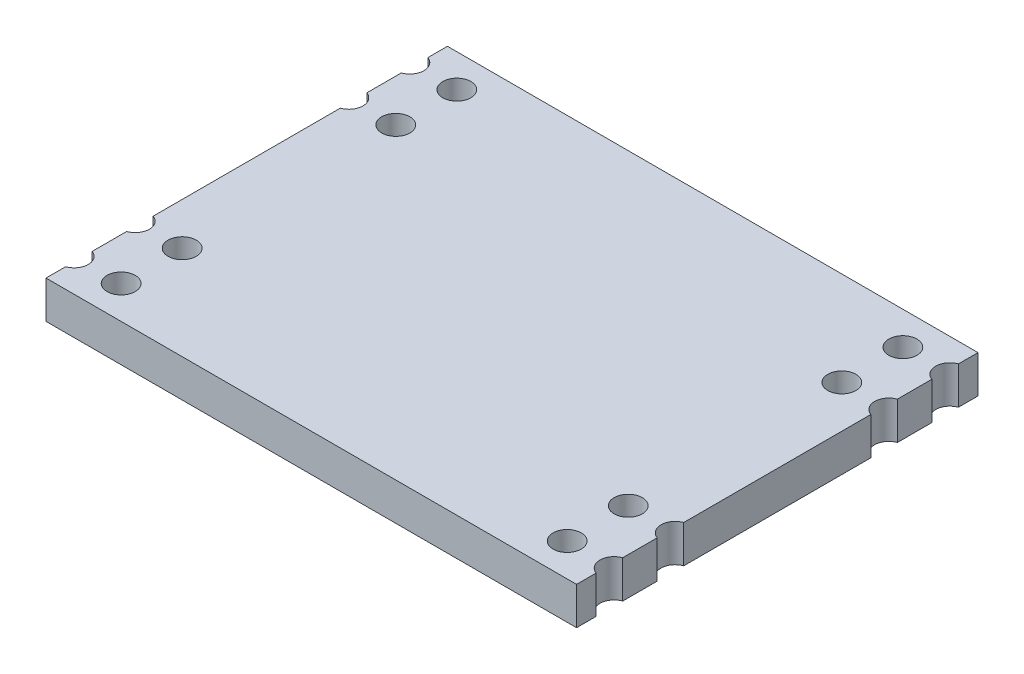
ISO-10303-21;
HEADER;
FILE_DESCRIPTION(('STEP AP214'),'2;1');
FILE_NAME('part.step','',(''),(''),'','','');
FILE_SCHEMA(('AUTOMOTIVE_DESIGN { 1 0 10303 214 1 1 1 1 }'));
ENDSEC;
DATA;
#1=APPLICATION_CONTEXT('core data for automotive mechanical design processes');
#2=APPLICATION_PROTOCOL_DEFINITION('international standard','automotive_design',2000,#1);
#3=PRODUCT_CONTEXT('',#1,'mechanical');
#4=PRODUCT('Part','Part','',(#3));
#5=PRODUCT_RELATED_PRODUCT_CATEGORY('part','',(#4));
#6=PRODUCT_DEFINITION_FORMATION('','',#4);
#7=PRODUCT_DEFINITION_CONTEXT('part definition',#1,'design');
#8=PRODUCT_DEFINITION('design','',#6,#7);
#9=PRODUCT_DEFINITION_SHAPE('','',#8);
#10=(LENGTH_UNIT() NAMED_UNIT(*) SI_UNIT(.MILLI.,.METRE.));
#11=(NAMED_UNIT(*) PLANE_ANGLE_UNIT() SI_UNIT($,.RADIAN.));
#12=(NAMED_UNIT(*) SI_UNIT($,.STERADIAN.) SOLID_ANGLE_UNIT());
#13=UNCERTAINTY_MEASURE_WITH_UNIT(LENGTH_MEASURE(1.E-05),#10,'distance_accuracy_value','');
#14=(GEOMETRIC_REPRESENTATION_CONTEXT(3) GLOBAL_UNCERTAINTY_ASSIGNED_CONTEXT((#13)) GLOBAL_UNIT_ASSIGNED_CONTEXT((#10,
#11,#12)) REPRESENTATION_CONTEXT('',''));
#15=CARTESIAN_POINT('',(0.,0.,0.));
#16=DIRECTION('',(0.,0.,1.));
#17=DIRECTION('',(1.,0.,0.));
#18=AXIS2_PLACEMENT_3D('',#15,#16,#17);
#19=CARTESIAN_POINT('',(11.3,1.6,-8.55));
#20=DIRECTION('',(-1.,0.,0.));
#21=DIRECTION('',(0.,0.,1.));
#22=AXIS2_PLACEMENT_3D('',#19,#20,#21);
#23=PLANE('',#22);
#24=DIRECTION('',(0.,0.,-1.));
#25=VECTOR('',#24,1.);
#26=CARTESIAN_POINT('',(11.3,0.,-8.55));
#27=LINE('',#26,#25);
#28=CARTESIAN_POINT('',(11.3,0.,8.55000000000001));
#29=VERTEX_POINT('',#28);
#30=CARTESIAN_POINT('',(11.3,0.,7.71568542494924));
#31=VERTEX_POINT('',#30);
#32=EDGE_CURVE('E197',#29,#31,#27,.T.);
#33=ORIENTED_EDGE('',*,*,#32,.T.);
#34=DIRECTION('',(0.,1.,0.));
#35=VECTOR('',#34,1.);
#36=CARTESIAN_POINT('',(11.3,0.,7.71568542494924));
#37=LINE('',#36,#35);
#38=CARTESIAN_POINT('',(11.3,1.6,7.71568542494924));
#39=VERTEX_POINT('',#38);
#40=EDGE_CURVE('E57',#31,#39,#37,.T.);
#41=ORIENTED_EDGE('',*,*,#40,.T.);
#42=DIRECTION('',(0.,0.,-1.));
#43=VECTOR('',#42,1.);
#44=CARTESIAN_POINT('',(11.3,1.6,-8.55));
#45=LINE('',#44,#43);
#46=CARTESIAN_POINT('',(11.3,1.6,8.55000000000001));
#47=VERTEX_POINT('',#46);
#48=EDGE_CURVE('E276',#47,#39,#45,.T.);
#49=ORIENTED_EDGE('',*,*,#48,.F.);
#50=DIRECTION('',(0.,-1.,0.));
#51=VECTOR('',#50,1.);
#52=CARTESIAN_POINT('',(11.3,1.6,8.55000000000001));
#53=LINE('',#52,#51);
#54=EDGE_CURVE('E221',#47,#29,#53,.T.);
#55=ORIENTED_EDGE('',*,*,#54,.T.);
#56=EDGE_LOOP('',(#33,#41,#49,#55));
#57=FACE_BOUND('',#56,.T.);
#58=ADVANCED_FACE('F34',(#57),#23,.F.);
#59=CARTESIAN_POINT('',(11.3,1.6,6.58431457505076));
#60=VERTEX_POINT('',#59);
#61=CARTESIAN_POINT('',(11.3,1.6,5.11568542494924));
#62=VERTEX_POINT('',#61);
#63=EDGE_CURVE('E280',#60,#62,#45,.T.);
#64=ORIENTED_EDGE('',*,*,#63,.F.);
#65=DIRECTION('',(0.,1.,0.));
#66=VECTOR('',#65,1.);
#67=CARTESIAN_POINT('',(11.3,0.,6.58431457505076));
#68=LINE('',#67,#66);
#69=CARTESIAN_POINT('',(11.3,0.,6.58431457505076));
#70=VERTEX_POINT('',#69);
#71=EDGE_CURVE('E299',#60,#70,#68,.F.);
#72=ORIENTED_EDGE('',*,*,#71,.T.);
#73=CARTESIAN_POINT('',(11.3,0.,5.11568542494924));
#74=VERTEX_POINT('',#73);
#75=EDGE_CURVE('E194',#70,#74,#27,.T.);
#76=ORIENTED_EDGE('',*,*,#75,.T.);
#77=DIRECTION('',(0.,1.,0.));
#78=VECTOR('',#77,1.);
#79=CARTESIAN_POINT('',(11.3,0.,5.11568542494924));
#80=LINE('',#79,#78);
#81=EDGE_CURVE('E49',#74,#62,#80,.T.);
#82=ORIENTED_EDGE('',*,*,#81,.T.);
#83=EDGE_LOOP('',(#64,#72,#76,#82));
#84=FACE_BOUND('',#83,.T.);
#85=ADVANCED_FACE('F390',(#84),#23,.F.);
#86=CARTESIAN_POINT('',(-11.3,1.6,-8.55));
#87=DIRECTION('',(1.,0.,0.));
#88=DIRECTION('',(0.,0.,-1.));
#89=AXIS2_PLACEMENT_3D('',#86,#87,#88);
#90=PLANE('',#89);
#91=DIRECTION('',(0.,1.,0.));
#92=VECTOR('',#91,1.);
#93=CARTESIAN_POINT('',(-11.3,0.,6.58431457505076));
#94=LINE('',#93,#92);
#95=CARTESIAN_POINT('',(-11.3,1.6,6.58431457505076));
#96=VERTEX_POINT('',#95);
#97=CARTESIAN_POINT('',(-11.3,0.,6.58431457505076));
#98=VERTEX_POINT('',#97);
#99=EDGE_CURVE('E331',#96,#98,#94,.F.);
#100=ORIENTED_EDGE('',*,*,#99,.F.);
#101=DIRECTION('',(0.,0.,1.));
#102=VECTOR('',#101,1.);
#103=CARTESIAN_POINT('',(-11.3,1.6,-8.55));
#104=LINE('',#103,#102);
#105=CARTESIAN_POINT('',(-11.3,1.6,5.11568542494924));
#106=VERTEX_POINT('',#105);
#107=EDGE_CURVE('E469',#106,#96,#104,.T.);
#108=ORIENTED_EDGE('',*,*,#107,.F.);
#109=DIRECTION('',(0.,1.,0.));
#110=VECTOR('',#109,1.);
#111=CARTESIAN_POINT('',(-11.3,0.,5.11568542494924));
#112=LINE('',#111,#110);
#113=CARTESIAN_POINT('',(-11.3,0.,5.11568542494924));
#114=VERTEX_POINT('',#113);
#115=EDGE_CURVE('E319',#114,#106,#112,.T.);
#116=ORIENTED_EDGE('',*,*,#115,.F.);
#117=DIRECTION('',(0.,0.,1.));
#118=VECTOR('',#117,1.);
#119=CARTESIAN_POINT('',(-11.3,0.,-8.55));
#120=LINE('',#119,#118);
#121=EDGE_CURVE('E212',#114,#98,#120,.T.);
#122=ORIENTED_EDGE('',*,*,#121,.T.);
#123=EDGE_LOOP('',(#100,#108,#116,#122));
#124=FACE_BOUND('',#123,.T.);
#125=ADVANCED_FACE('F394',(#124),#90,.F.);
#126=DIRECTION('',(0.,1.,0.));
#127=VECTOR('',#126,1.);
#128=CARTESIAN_POINT('',(-11.3,0.,7.71568542494924));
#129=LINE('',#128,#127);
#130=CARTESIAN_POINT('',(-11.3,0.,7.71568542494924));
#131=VERTEX_POINT('',#130);
#132=CARTESIAN_POINT('',(-11.3,1.6,7.71568542494924));
#133=VERTEX_POINT('',#132);
#134=EDGE_CURVE('E329',#131,#133,#129,.T.);
#135=ORIENTED_EDGE('',*,*,#134,.F.);
#136=CARTESIAN_POINT('',(-11.3,0.,8.55000000000001));
#137=VERTEX_POINT('',#136);
#138=EDGE_CURVE('E207',#131,#137,#120,.T.);
#139=ORIENTED_EDGE('',*,*,#138,.T.);
#140=DIRECTION('',(0.,-1.,0.));
#141=VECTOR('',#140,1.);
#142=CARTESIAN_POINT('',(-11.3,1.6,8.55000000000001));
#143=LINE('',#142,#141);
#144=CARTESIAN_POINT('',(-11.3,1.6,8.55000000000001));
#145=VERTEX_POINT('',#144);
#146=EDGE_CURVE('E223',#145,#137,#143,.T.);
#147=ORIENTED_EDGE('',*,*,#146,.F.);
#148=EDGE_CURVE('E283',#133,#145,#104,.T.);
#149=ORIENTED_EDGE('',*,*,#148,.F.);
#150=EDGE_LOOP('',(#135,#139,#147,#149));
#151=FACE_BOUND('',#150,.T.);
#152=ADVANCED_FACE('F405',(#151),#90,.F.);
#153=DIRECTION('',(0.,1.,0.));
#154=VECTOR('',#153,1.);
#155=CARTESIAN_POINT('',(-11.3,0.,3.98431457505076));
#156=LINE('',#155,#154);
#157=CARTESIAN_POINT('',(-11.3,1.6,3.98431457505076));
#158=VERTEX_POINT('',#157);
#159=CARTESIAN_POINT('',(-11.3,0.,3.98431457505076));
#160=VERTEX_POINT('',#159);
#161=EDGE_CURVE('E327',#158,#160,#156,.F.);
#162=ORIENTED_EDGE('',*,*,#161,.F.);
#163=CARTESIAN_POINT('',(-11.3,1.6,-3.98431457505076));
#164=VERTEX_POINT('',#163);
#165=EDGE_CURVE('E455',#164,#158,#104,.T.);
#166=ORIENTED_EDGE('',*,*,#165,.F.);
#167=DIRECTION('',(0.,1.,0.));
#168=VECTOR('',#167,1.);
#169=CARTESIAN_POINT('',(-11.3,0.,-3.98431457505076));
#170=LINE('',#169,#168);
#171=CARTESIAN_POINT('',(-11.3,0.,-3.98431457505076));
#172=VERTEX_POINT('',#171);
#173=EDGE_CURVE('E242',#164,#172,#170,.F.);
#174=ORIENTED_EDGE('',*,*,#173,.T.);
#175=EDGE_CURVE('E453',#172,#160,#120,.T.);
#176=ORIENTED_EDGE('',*,*,#175,.T.);
#177=EDGE_LOOP('',(#162,#166,#174,#176));
#178=FACE_BOUND('',#177,.T.);
#179=ADVANCED_FACE('F398',(#178),#90,.F.);
#180=DIRECTION('',(0.,1.,0.));
#181=VECTOR('',#180,1.);
#182=CARTESIAN_POINT('',(11.3,0.,-6.58431457505076));
#183=LINE('',#182,#181);
#184=CARTESIAN_POINT('',(11.3,1.6,-6.58431457505076));
#185=VERTEX_POINT('',#184);
#186=CARTESIAN_POINT('',(11.3,0.,-6.58431457505076));
#187=VERTEX_POINT('',#186);
#188=EDGE_CURVE('E360',#185,#187,#183,.F.);
#189=ORIENTED_EDGE('',*,*,#188,.F.);
#190=CARTESIAN_POINT('',(11.3,1.6,-5.11568542494923));
#191=VERTEX_POINT('',#190);
#192=EDGE_CURVE('E281',#191,#185,#45,.T.);
#193=ORIENTED_EDGE('',*,*,#192,.F.);
#194=DIRECTION('',(0.,1.,0.));
#195=VECTOR('',#194,1.);
#196=CARTESIAN_POINT('',(11.3,0.,-5.11568542494923));
#197=LINE('',#196,#195);
#198=CARTESIAN_POINT('',(11.3,0.,-5.11568542494923));
#199=VERTEX_POINT('',#198);
#200=EDGE_CURVE('E348',#199,#191,#197,.T.);
#201=ORIENTED_EDGE('',*,*,#200,.F.);
#202=EDGE_CURVE('E195',#199,#187,#27,.T.);
#203=ORIENTED_EDGE('',*,*,#202,.T.);
#204=EDGE_LOOP('',(#189,#193,#201,#203));
#205=FACE_BOUND('',#204,.T.);
#206=ADVANCED_FACE('F36',(#205),#23,.F.);
#207=DIRECTION('',(0.,1.,0.));
#208=VECTOR('',#207,1.);
#209=CARTESIAN_POINT('',(11.3,0.,-7.71568542494923));
#210=LINE('',#209,#208);
#211=CARTESIAN_POINT('',(11.3,0.,-7.71568542494923));
#212=VERTEX_POINT('',#211);
#213=CARTESIAN_POINT('',(11.3,1.6,-7.71568542494923));
#214=VERTEX_POINT('',#213);
#215=EDGE_CURVE('E358',#212,#214,#210,.T.);
#216=ORIENTED_EDGE('',*,*,#215,.F.);
#217=CARTESIAN_POINT('',(11.3,0.,-8.55));
#218=VERTEX_POINT('',#217);
#219=EDGE_CURVE('E198',#212,#218,#27,.T.);
#220=ORIENTED_EDGE('',*,*,#219,.T.);
#221=DIRECTION('',(0.,-1.,0.));
#222=VECTOR('',#221,1.);
#223=CARTESIAN_POINT('',(11.3,1.6,-8.55));
#224=LINE('',#223,#222);
#225=CARTESIAN_POINT('',(11.3,1.6,-8.55));
#226=VERTEX_POINT('',#225);
#227=EDGE_CURVE('E11',#226,#218,#224,.T.);
#228=ORIENTED_EDGE('',*,*,#227,.F.);
#229=EDGE_CURVE('E220',#214,#226,#45,.T.);
#230=ORIENTED_EDGE('',*,*,#229,.F.);
#231=EDGE_LOOP('',(#216,#220,#228,#230));
#232=FACE_BOUND('',#231,.T.);
#233=ADVANCED_FACE('F396',(#232),#23,.F.);
#234=CARTESIAN_POINT('',(11.3,1.6,3.98431457505076));
#235=VERTEX_POINT('',#234);
#236=CARTESIAN_POINT('',(11.3,1.6,-3.98431457505076));
#237=VERTEX_POINT('',#236);
#238=EDGE_CURVE('E186',#235,#237,#45,.T.);
#239=ORIENTED_EDGE('',*,*,#238,.F.);
#240=DIRECTION('',(0.,1.,0.));
#241=VECTOR('',#240,1.);
#242=CARTESIAN_POINT('',(11.3,0.,3.98431457505076));
#243=LINE('',#242,#241);
#244=CARTESIAN_POINT('',(11.3,0.,3.98431457505076));
#245=VERTEX_POINT('',#244);
#246=EDGE_CURVE('E171',#235,#245,#243,.F.);
#247=ORIENTED_EDGE('',*,*,#246,.T.);
#248=CARTESIAN_POINT('',(11.3,0.,-3.98431457505076));
#249=VERTEX_POINT('',#248);
#250=EDGE_CURVE('E184',#245,#249,#27,.T.);
#251=ORIENTED_EDGE('',*,*,#250,.T.);
#252=DIRECTION('',(0.,1.,0.));
#253=VECTOR('',#252,1.);
#254=CARTESIAN_POINT('',(11.3,0.,-3.98431457505076));
#255=LINE('',#254,#253);
#256=EDGE_CURVE('E356',#237,#249,#255,.F.);
#257=ORIENTED_EDGE('',*,*,#256,.F.);
#258=EDGE_LOOP('',(#239,#247,#251,#257));
#259=FACE_BOUND('',#258,.T.);
#260=ADVANCED_FACE('F182',(#259),#23,.F.);
#261=CARTESIAN_POINT('',(-11.3,0.,-8.55));
#262=VERTEX_POINT('',#261);
#263=CARTESIAN_POINT('',(-11.3,0.,-7.71568542494924));
#264=VERTEX_POINT('',#263);
#265=EDGE_CURVE('E214',#262,#264,#120,.T.);
#266=ORIENTED_EDGE('',*,*,#265,.T.);
#267=DIRECTION('',(0.,1.,0.));
#268=VECTOR('',#267,1.);
#269=CARTESIAN_POINT('',(-11.3,0.,-7.71568542494924));
#270=LINE('',#269,#268);
#271=CARTESIAN_POINT('',(-11.3,1.6,-7.71568542494924));
#272=VERTEX_POINT('',#271);
#273=EDGE_CURVE('E262',#264,#272,#270,.T.);
#274=ORIENTED_EDGE('',*,*,#273,.T.);
#275=CARTESIAN_POINT('',(-11.3,1.6,-8.55));
#276=VERTEX_POINT('',#275);
#277=EDGE_CURVE('E232',#276,#272,#104,.T.);
#278=ORIENTED_EDGE('',*,*,#277,.F.);
#279=DIRECTION('',(0.,-1.,0.));
#280=VECTOR('',#279,1.);
#281=CARTESIAN_POINT('',(-11.3,1.6,-8.55));
#282=LINE('',#281,#280);
#283=EDGE_CURVE('E42',#276,#262,#282,.T.);
#284=ORIENTED_EDGE('',*,*,#283,.T.);
#285=EDGE_LOOP('',(#266,#274,#278,#284));
#286=FACE_BOUND('',#285,.T.);
#287=ADVANCED_FACE('F229',(#286),#90,.F.);
#288=CARTESIAN_POINT('',(-11.3,1.6,-6.58431457505076));
#289=VERTEX_POINT('',#288);
#290=CARTESIAN_POINT('',(-11.3,1.6,-5.11568542494924));
#291=VERTEX_POINT('',#290);
#292=EDGE_CURVE('E284',#289,#291,#104,.T.);
#293=ORIENTED_EDGE('',*,*,#292,.F.);
#294=DIRECTION('',(0.,1.,0.));
#295=VECTOR('',#294,1.);
#296=CARTESIAN_POINT('',(-11.3,0.,-6.58431457505076));
#297=LINE('',#296,#295);
#298=CARTESIAN_POINT('',(-11.3,0.,-6.58431457505076));
#299=VERTEX_POINT('',#298);
#300=EDGE_CURVE('E260',#289,#299,#297,.F.);
#301=ORIENTED_EDGE('',*,*,#300,.T.);
#302=CARTESIAN_POINT('',(-11.3,0.,-5.11568542494924));
#303=VERTEX_POINT('',#302);
#304=EDGE_CURVE('E218',#299,#303,#120,.T.);
#305=ORIENTED_EDGE('',*,*,#304,.T.);
#306=DIRECTION('',(0.,1.,0.));
#307=VECTOR('',#306,1.);
#308=CARTESIAN_POINT('',(-11.3,0.,-5.11568542494924));
#309=LINE('',#308,#307);
#310=EDGE_CURVE('E246',#303,#291,#309,.T.);
#311=ORIENTED_EDGE('',*,*,#310,.T.);
#312=EDGE_LOOP('',(#293,#301,#305,#311));
#313=FACE_BOUND('',#312,.T.);
#314=ADVANCED_FACE('F413',(#313),#90,.F.);
#315=CARTESIAN_POINT('',(-11.3,1.6,-8.55));
#316=DIRECTION('',(0.,0.,1.));
#317=DIRECTION('',(1.,0.,0.));
#318=AXIS2_PLACEMENT_3D('',#315,#316,#317);
#319=PLANE('',#318);
#320=DIRECTION('',(-1.,0.,0.));
#321=VECTOR('',#320,1.);
#322=CARTESIAN_POINT('',(-11.3,0.,-8.55));
#323=LINE('',#322,#321);
#324=EDGE_CURVE('E203',#218,#262,#323,.T.);
#325=ORIENTED_EDGE('',*,*,#324,.T.);
#326=ORIENTED_EDGE('',*,*,#283,.F.);
#327=DIRECTION('',(-1.,0.,0.));
#328=VECTOR('',#327,1.);
#329=CARTESIAN_POINT('',(-11.3,1.6,-8.55));
#330=LINE('',#329,#328);
#331=EDGE_CURVE('E279',#226,#276,#330,.T.);
#332=ORIENTED_EDGE('',*,*,#331,.F.);
#333=ORIENTED_EDGE('',*,*,#227,.T.);
#334=EDGE_LOOP('',(#325,#326,#332,#333));
#335=FACE_BOUND('',#334,.T.);
#336=ADVANCED_FACE('F417',(#335),#319,.F.);
#337=CARTESIAN_POINT('',(-11.3,1.6,8.55000000000001));
#338=DIRECTION('',(0.,0.,-1.));
#339=DIRECTION('',(-1.,0.,0.));
#340=AXIS2_PLACEMENT_3D('',#337,#338,#339);
#341=PLANE('',#340);
#342=DIRECTION('',(1.,0.,0.));
#343=VECTOR('',#342,1.);
#344=CARTESIAN_POINT('',(-11.3,0.,8.55000000000001));
#345=LINE('',#344,#343);
#346=EDGE_CURVE('E217',#137,#29,#345,.T.);
#347=ORIENTED_EDGE('',*,*,#346,.T.);
#348=ORIENTED_EDGE('',*,*,#54,.F.);
#349=DIRECTION('',(1.,0.,0.));
#350=VECTOR('',#349,1.);
#351=CARTESIAN_POINT('',(-11.3,1.6,8.55000000000001));
#352=LINE('',#351,#350);
#353=EDGE_CURVE('E224',#145,#47,#352,.T.);
#354=ORIENTED_EDGE('',*,*,#353,.F.);
#355=ORIENTED_EDGE('',*,*,#146,.T.);
#356=EDGE_LOOP('',(#347,#348,#354,#355));
#357=FACE_BOUND('',#356,.T.);
#358=ADVANCED_FACE('F296',(#357),#341,.F.);
#359=CARTESIAN_POINT('',(0.,1.6,0.));
#360=DIRECTION('',(0.,1.,0.));
#361=DIRECTION('',(0.,0.,1.));
#362=AXIS2_PLACEMENT_3D('',#359,#360,#361);
#363=PLANE('',#362);
#364=CARTESIAN_POINT('',(11.5,1.6,7.15));
#365=DIRECTION('',(0.,1.,0.));
#366=DIRECTION('',(0.,0.,-1.));
#367=AXIS2_PLACEMENT_3D('',#364,#365,#366);
#368=CIRCLE('',#367,0.6);
#369=EDGE_CURVE('E177',#60,#39,#368,.T.);
#370=ORIENTED_EDGE('',*,*,#369,.F.);
#371=ORIENTED_EDGE('',*,*,#63,.T.);
#372=CARTESIAN_POINT('',(11.5,1.6,4.55));
#373=DIRECTION('',(0.,1.,0.));
#374=DIRECTION('',(0.,0.,-1.));
#375=AXIS2_PLACEMENT_3D('',#372,#373,#374);
#376=CIRCLE('',#375,0.6);
#377=EDGE_CURVE('E178',#235,#62,#376,.T.);
#378=ORIENTED_EDGE('',*,*,#377,.F.);
#379=ORIENTED_EDGE('',*,*,#238,.T.);
#380=CARTESIAN_POINT('',(11.5,1.6,-4.55));
#381=DIRECTION('',(0.,-1.,0.));
#382=DIRECTION('',(0.,0.,1.));
#383=AXIS2_PLACEMENT_3D('',#380,#381,#382);
#384=CIRCLE('',#383,0.6);
#385=EDGE_CURVE('E337',#237,#191,#384,.T.);
#386=ORIENTED_EDGE('',*,*,#385,.T.);
#387=ORIENTED_EDGE('',*,*,#192,.T.);
#388=CARTESIAN_POINT('',(11.5,1.6,-7.15));
#389=DIRECTION('',(0.,-1.,0.));
#390=DIRECTION('',(0.,0.,1.));
#391=AXIS2_PLACEMENT_3D('',#388,#389,#390);
#392=CIRCLE('',#391,0.6);
#393=EDGE_CURVE('E349',#185,#214,#392,.T.);
#394=ORIENTED_EDGE('',*,*,#393,.T.);
#395=ORIENTED_EDGE('',*,*,#229,.T.);
#396=ORIENTED_EDGE('',*,*,#331,.T.);
#397=ORIENTED_EDGE('',*,*,#277,.T.);
#398=CARTESIAN_POINT('',(-11.5,1.6,-7.15));
#399=DIRECTION('',(0.,1.,0.));
#400=DIRECTION('',(0.,0.,1.));
#401=AXIS2_PLACEMENT_3D('',#398,#399,#400);
#402=CIRCLE('',#401,0.6);
#403=EDGE_CURVE('E243',#289,#272,#402,.T.);
#404=ORIENTED_EDGE('',*,*,#403,.F.);
#405=ORIENTED_EDGE('',*,*,#292,.T.);
#406=CARTESIAN_POINT('',(-11.5,1.6,-4.55));
#407=DIRECTION('',(0.,1.,0.));
#408=DIRECTION('',(0.,0.,1.));
#409=AXIS2_PLACEMENT_3D('',#406,#407,#408);
#410=CIRCLE('',#409,0.6);
#411=EDGE_CURVE('E255',#164,#291,#410,.T.);
#412=ORIENTED_EDGE('',*,*,#411,.F.);
#413=ORIENTED_EDGE('',*,*,#165,.T.);
#414=CARTESIAN_POINT('',(-11.5,1.6,4.55));
#415=DIRECTION('',(0.,-1.,0.));
#416=DIRECTION('',(0.,0.,-1.));
#417=AXIS2_PLACEMENT_3D('',#414,#415,#416);
#418=CIRCLE('',#417,0.6);
#419=EDGE_CURVE('E311',#158,#106,#418,.T.);
#420=ORIENTED_EDGE('',*,*,#419,.T.);
#421=ORIENTED_EDGE('',*,*,#107,.T.);
#422=CARTESIAN_POINT('',(-11.5,1.6,7.15));
#423=DIRECTION('',(0.,-1.,0.));
#424=DIRECTION('',(0.,0.,-1.));
#425=AXIS2_PLACEMENT_3D('',#422,#423,#424);
#426=CIRCLE('',#425,0.6);
#427=EDGE_CURVE('E320',#96,#133,#426,.T.);
#428=ORIENTED_EDGE('',*,*,#427,.T.);
#429=ORIENTED_EDGE('',*,*,#148,.T.);
#430=ORIENTED_EDGE('',*,*,#353,.T.);
#431=ORIENTED_EDGE('',*,*,#48,.T.);
#432=EDGE_LOOP('',(#370,#371,#378,#379,#386,#387,#394,#395,#396,#397,#404,#405,#412,#413,#420,
#421,#428,#429,#430,#431));
#433=FACE_BOUND('',#432,.T.);
#434=CARTESIAN_POINT('',(9.50000000000001,1.6,7.15));
#435=DIRECTION('',(0.,1.,0.));
#436=DIRECTION('',(0.,0.,-1.));
#437=AXIS2_PLACEMENT_3D('',#434,#435,#436);
#438=CIRCLE('',#437,0.6);
#439=CARTESIAN_POINT('',(9.50000000000001,1.6,6.55));
#440=VERTEX_POINT('',#439);
#441=EDGE_CURVE('E312',#440,#440,#438,.T.);
#442=ORIENTED_EDGE('',*,*,#441,.F.);
#443=EDGE_LOOP('',(#442));
#444=FACE_BOUND('',#443,.T.);
#445=CARTESIAN_POINT('',(9.50000000000001,1.6,4.55));
#446=DIRECTION('',(0.,1.,0.));
#447=DIRECTION('',(0.,0.,-1.));
#448=AXIS2_PLACEMENT_3D('',#445,#446,#447);
#449=CIRCLE('',#448,0.6);
#450=CARTESIAN_POINT('',(9.50000000000001,1.6,3.95));
#451=VERTEX_POINT('',#450);
#452=EDGE_CURVE('E298',#451,#451,#449,.T.);
#453=ORIENTED_EDGE('',*,*,#452,.F.);
#454=EDGE_LOOP('',(#453));
#455=FACE_BOUND('',#454,.T.);
#456=CARTESIAN_POINT('',(-9.50000000000001,1.6,7.15));
#457=DIRECTION('',(0.,-1.,0.));
#458=DIRECTION('',(0.,0.,-1.));
#459=AXIS2_PLACEMENT_3D('',#456,#457,#458);
#460=CIRCLE('',#459,0.6);
#461=CARTESIAN_POINT('',(-9.50000000000001,1.6,6.55));
#462=VERTEX_POINT('',#461);
#463=EDGE_CURVE('E338',#462,#462,#460,.T.);
#464=ORIENTED_EDGE('',*,*,#463,.T.);
#465=EDGE_LOOP('',(#464));
#466=FACE_BOUND('',#465,.T.);
#467=CARTESIAN_POINT('',(-9.50000000000001,1.6,4.55));
#468=DIRECTION('',(0.,-1.,0.));
#469=DIRECTION('',(0.,0.,-1.));
#470=AXIS2_PLACEMENT_3D('',#467,#468,#469);
#471=CIRCLE('',#470,0.6);
#472=CARTESIAN_POINT('',(-9.50000000000001,1.6,3.95));
#473=VERTEX_POINT('',#472);
#474=EDGE_CURVE('E333',#473,#473,#471,.T.);
#475=ORIENTED_EDGE('',*,*,#474,.T.);
#476=EDGE_LOOP('',(#475));
#477=FACE_BOUND('',#476,.T.);
#478=CARTESIAN_POINT('',(9.50000000000001,1.6,-7.15));
#479=DIRECTION('',(0.,-1.,0.));
#480=DIRECTION('',(0.,0.,1.));
#481=AXIS2_PLACEMENT_3D('',#478,#479,#480);
#482=CIRCLE('',#481,0.6);
#483=CARTESIAN_POINT('',(9.50000000000001,1.6,-6.55));
#484=VERTEX_POINT('',#483);
#485=EDGE_CURVE('E364',#484,#484,#482,.T.);
#486=ORIENTED_EDGE('',*,*,#485,.T.);
#487=EDGE_LOOP('',(#486));
#488=FACE_BOUND('',#487,.T.);
#489=CARTESIAN_POINT('',(9.50000000000001,1.6,-4.55));
#490=DIRECTION('',(0.,-1.,0.));
#491=DIRECTION('',(0.,0.,1.));
#492=AXIS2_PLACEMENT_3D('',#489,#490,#491);
#493=CIRCLE('',#492,0.6);
#494=CARTESIAN_POINT('',(9.50000000000001,1.6,-3.95));
#495=VERTEX_POINT('',#494);
#496=EDGE_CURVE('E251',#495,#495,#493,.T.);
#497=ORIENTED_EDGE('',*,*,#496,.T.);
#498=EDGE_LOOP('',(#497));
#499=FACE_BOUND('',#498,.T.);
#500=CARTESIAN_POINT('',(-9.50000000000001,1.6,-7.15));
#501=DIRECTION('',(0.,1.,0.));
#502=DIRECTION('',(0.,0.,1.));
#503=AXIS2_PLACEMENT_3D('',#500,#501,#502);
#504=CIRCLE('',#503,0.6);
#505=CARTESIAN_POINT('',(-9.50000000000001,1.6,-6.55));
#506=VERTEX_POINT('',#505);
#507=EDGE_CURVE('E268',#506,#506,#504,.T.);
#508=ORIENTED_EDGE('',*,*,#507,.F.);
#509=EDGE_LOOP('',(#508));
#510=FACE_BOUND('',#509,.T.);
#511=CARTESIAN_POINT('',(-9.50000000000001,1.6,-4.55));
#512=DIRECTION('',(0.,1.,0.));
#513=DIRECTION('',(0.,0.,1.));
#514=AXIS2_PLACEMENT_3D('',#511,#512,#513);
#515=CIRCLE('',#514,0.6);
#516=CARTESIAN_POINT('',(-9.50000000000001,1.6,-3.95));
#517=VERTEX_POINT('',#516);
#518=EDGE_CURVE('E264',#517,#517,#515,.T.);
#519=ORIENTED_EDGE('',*,*,#518,.F.);
#520=EDGE_LOOP('',(#519));
#521=FACE_BOUND('',#520,.T.);
#522=ADVANCED_FACE('F289',(#433,#444,#455,#466,#477,#488,#499,#510,#521),#363,.T.);
#523=CARTESIAN_POINT('',(0.,0.,0.));
#524=DIRECTION('',(0.,1.,0.));
#525=DIRECTION('',(0.,0.,1.));
#526=AXIS2_PLACEMENT_3D('',#523,#524,#525);
#527=PLANE('',#526);
#528=CARTESIAN_POINT('',(9.50000000000001,0.,7.15));
#529=DIRECTION('',(0.,1.,0.));
#530=DIRECTION('',(0.,0.,-1.));
#531=AXIS2_PLACEMENT_3D('',#528,#529,#530);
#532=CIRCLE('',#531,0.6);
#533=CARTESIAN_POINT('',(9.50000000000001,0.,6.55));
#534=VERTEX_POINT('',#533);
#535=EDGE_CURVE('E308',#534,#534,#532,.T.);
#536=ORIENTED_EDGE('',*,*,#535,.T.);
#537=EDGE_LOOP('',(#536));
#538=FACE_BOUND('',#537,.T.);
#539=CARTESIAN_POINT('',(9.50000000000001,0.,4.55));
#540=DIRECTION('',(0.,1.,0.));
#541=DIRECTION('',(0.,0.,-1.));
#542=AXIS2_PLACEMENT_3D('',#539,#540,#541);
#543=CIRCLE('',#542,0.6);
#544=CARTESIAN_POINT('',(9.50000000000001,0.,3.95));
#545=VERTEX_POINT('',#544);
#546=EDGE_CURVE('E302',#545,#545,#543,.T.);
#547=ORIENTED_EDGE('',*,*,#546,.T.);
#548=EDGE_LOOP('',(#547));
#549=FACE_BOUND('',#548,.T.);
#550=ORIENTED_EDGE('',*,*,#75,.F.);
#551=CARTESIAN_POINT('',(11.5,0.,7.15));
#552=DIRECTION('',(0.,1.,0.));
#553=DIRECTION('',(0.,0.,-1.));
#554=AXIS2_PLACEMENT_3D('',#551,#552,#553);
#555=CIRCLE('',#554,0.6);
#556=EDGE_CURVE('E187',#70,#31,#555,.T.);
#557=ORIENTED_EDGE('',*,*,#556,.T.);
#558=ORIENTED_EDGE('',*,*,#32,.F.);
#559=ORIENTED_EDGE('',*,*,#346,.F.);
#560=ORIENTED_EDGE('',*,*,#138,.F.);
#561=CARTESIAN_POINT('',(-11.5,0.,7.15));
#562=DIRECTION('',(0.,-1.,0.));
#563=DIRECTION('',(0.,0.,-1.));
#564=AXIS2_PLACEMENT_3D('',#561,#562,#563);
#565=CIRCLE('',#564,0.6);
#566=EDGE_CURVE('E317',#98,#131,#565,.T.);
#567=ORIENTED_EDGE('',*,*,#566,.F.);
#568=ORIENTED_EDGE('',*,*,#121,.F.);
#569=CARTESIAN_POINT('',(-11.5,0.,4.55));
#570=DIRECTION('',(0.,-1.,0.));
#571=DIRECTION('',(0.,0.,-1.));
#572=AXIS2_PLACEMENT_3D('',#569,#570,#571);
#573=CIRCLE('',#572,0.6);
#574=EDGE_CURVE('E322',#160,#114,#573,.T.);
#575=ORIENTED_EDGE('',*,*,#574,.F.);
#576=ORIENTED_EDGE('',*,*,#175,.F.);
#577=CARTESIAN_POINT('',(-11.5,0.,-4.55));
#578=DIRECTION('',(0.,1.,0.));
#579=DIRECTION('',(0.,0.,1.));
#580=AXIS2_PLACEMENT_3D('',#577,#578,#579);
#581=CIRCLE('',#580,0.6);
#582=EDGE_CURVE('E248',#172,#303,#581,.T.);
#583=ORIENTED_EDGE('',*,*,#582,.T.);
#584=ORIENTED_EDGE('',*,*,#304,.F.);
#585=CARTESIAN_POINT('',(-11.5,0.,-7.15));
#586=DIRECTION('',(0.,1.,0.));
#587=DIRECTION('',(0.,0.,1.));
#588=AXIS2_PLACEMENT_3D('',#585,#586,#587);
#589=CIRCLE('',#588,0.6);
#590=EDGE_CURVE('E237',#299,#264,#589,.T.);
#591=ORIENTED_EDGE('',*,*,#590,.T.);
#592=ORIENTED_EDGE('',*,*,#265,.F.);
#593=ORIENTED_EDGE('',*,*,#324,.F.);
#594=ORIENTED_EDGE('',*,*,#219,.F.);
#595=CARTESIAN_POINT('',(11.5,0.,-7.15));
#596=DIRECTION('',(0.,-1.,0.));
#597=DIRECTION('',(0.,0.,1.));
#598=AXIS2_PLACEMENT_3D('',#595,#596,#597);
#599=CIRCLE('',#598,0.6);
#600=EDGE_CURVE('E346',#187,#212,#599,.T.);
#601=ORIENTED_EDGE('',*,*,#600,.F.);
#602=ORIENTED_EDGE('',*,*,#202,.F.);
#603=CARTESIAN_POINT('',(11.5,0.,-4.55));
#604=DIRECTION('',(0.,-1.,0.));
#605=DIRECTION('',(0.,0.,1.));
#606=AXIS2_PLACEMENT_3D('',#603,#604,#605);
#607=CIRCLE('',#606,0.6);
#608=EDGE_CURVE('E193',#249,#199,#607,.T.);
#609=ORIENTED_EDGE('',*,*,#608,.F.);
#610=ORIENTED_EDGE('',*,*,#250,.F.);
#611=CARTESIAN_POINT('',(11.5,0.,4.55));
#612=DIRECTION('',(0.,1.,0.));
#613=DIRECTION('',(0.,0.,-1.));
#614=AXIS2_PLACEMENT_3D('',#611,#612,#613);
#615=CIRCLE('',#614,0.6);
#616=EDGE_CURVE('E168',#245,#74,#615,.T.);
#617=ORIENTED_EDGE('',*,*,#616,.T.);
#618=EDGE_LOOP('',(#550,#557,#558,#559,#560,#567,#568,#575,#576,#583,#584,#591,#592,#593,#594,
#601,#602,#609,#610,#617));
#619=FACE_BOUND('',#618,.T.);
#620=CARTESIAN_POINT('',(-9.50000000000001,0.,7.15));
#621=DIRECTION('',(0.,-1.,0.));
#622=DIRECTION('',(0.,0.,-1.));
#623=AXIS2_PLACEMENT_3D('',#620,#621,#622);
#624=CIRCLE('',#623,0.6);
#625=CARTESIAN_POINT('',(-9.50000000000001,0.,6.55));
#626=VERTEX_POINT('',#625);
#627=EDGE_CURVE('E334',#626,#626,#624,.T.);
#628=ORIENTED_EDGE('',*,*,#627,.F.);
#629=EDGE_LOOP('',(#628));
#630=FACE_BOUND('',#629,.T.);
#631=CARTESIAN_POINT('',(-9.50000000000001,0.,4.55));
#632=DIRECTION('',(0.,-1.,0.));
#633=DIRECTION('',(0.,0.,-1.));
#634=AXIS2_PLACEMENT_3D('',#631,#632,#633);
#635=CIRCLE('',#634,0.6);
#636=CARTESIAN_POINT('',(-9.50000000000001,0.,3.95));
#637=VERTEX_POINT('',#636);
#638=EDGE_CURVE('E341',#637,#637,#635,.T.);
#639=ORIENTED_EDGE('',*,*,#638,.F.);
#640=EDGE_LOOP('',(#639));
#641=FACE_BOUND('',#640,.T.);
#642=CARTESIAN_POINT('',(9.50000000000001,0.,-7.15));
#643=DIRECTION('',(0.,-1.,0.));
#644=DIRECTION('',(0.,0.,1.));
#645=AXIS2_PLACEMENT_3D('',#642,#643,#644);
#646=CIRCLE('',#645,0.6);
#647=CARTESIAN_POINT('',(9.50000000000001,0.,-6.55));
#648=VERTEX_POINT('',#647);
#649=EDGE_CURVE('E256',#648,#648,#646,.T.);
#650=ORIENTED_EDGE('',*,*,#649,.F.);
#651=EDGE_LOOP('',(#650));
#652=FACE_BOUND('',#651,.T.);
#653=CARTESIAN_POINT('',(9.50000000000001,0.,-4.55));
#654=DIRECTION('',(0.,-1.,0.));
#655=DIRECTION('',(0.,0.,1.));
#656=AXIS2_PLACEMENT_3D('',#653,#654,#655);
#657=CIRCLE('',#656,0.6);
#658=CARTESIAN_POINT('',(9.50000000000001,0.,-3.95));
#659=VERTEX_POINT('',#658);
#660=EDGE_CURVE('E366',#659,#659,#657,.T.);
#661=ORIENTED_EDGE('',*,*,#660,.F.);
#662=EDGE_LOOP('',(#661));
#663=FACE_BOUND('',#662,.T.);
#664=CARTESIAN_POINT('',(-9.50000000000001,0.,-7.15));
#665=DIRECTION('',(0.,1.,0.));
#666=DIRECTION('',(0.,0.,1.));
#667=AXIS2_PLACEMENT_3D('',#664,#665,#666);
#668=CIRCLE('',#667,0.6);
#669=CARTESIAN_POINT('',(-9.50000000000001,0.,-6.55));
#670=VERTEX_POINT('',#669);
#671=EDGE_CURVE('E265',#670,#670,#668,.T.);
#672=ORIENTED_EDGE('',*,*,#671,.T.);
#673=EDGE_LOOP('',(#672));
#674=FACE_BOUND('',#673,.T.);
#675=CARTESIAN_POINT('',(-9.50000000000001,0.,-4.55));
#676=DIRECTION('',(0.,1.,0.));
#677=DIRECTION('',(0.,0.,1.));
#678=AXIS2_PLACEMENT_3D('',#675,#676,#677);
#679=CIRCLE('',#678,0.6);
#680=CARTESIAN_POINT('',(-9.50000000000001,0.,-3.95));
#681=VERTEX_POINT('',#680);
#682=EDGE_CURVE('E271',#681,#681,#679,.T.);
#683=ORIENTED_EDGE('',*,*,#682,.T.);
#684=EDGE_LOOP('',(#683));
#685=FACE_BOUND('',#684,.T.);
#686=ADVANCED_FACE('F190',(#538,#549,#619,#630,#641,#652,#663,#674,#685),#527,.F.);
#687=CARTESIAN_POINT('',(-9.50000000000001,0.,-4.55));
#688=DIRECTION('',(0.,1.,0.));
#689=DIRECTION('',(0.,0.,1.));
#690=AXIS2_PLACEMENT_3D('',#687,#688,#689);
#691=CYLINDRICAL_SURFACE('',#690,0.6);
#692=ORIENTED_EDGE('',*,*,#682,.F.);
#693=EDGE_LOOP('',(#692));
#694=FACE_BOUND('',#693,.T.);
#695=ORIENTED_EDGE('',*,*,#518,.T.);
#696=EDGE_LOOP('',(#695));
#697=FACE_BOUND('',#696,.T.);
#698=ADVANCED_FACE('F434',(#694,#697),#691,.F.);
#699=CARTESIAN_POINT('',(-9.50000000000001,0.,-7.15));
#700=DIRECTION('',(0.,1.,0.));
#701=DIRECTION('',(0.,0.,1.));
#702=AXIS2_PLACEMENT_3D('',#699,#700,#701);
#703=CYLINDRICAL_SURFACE('',#702,0.6);
#704=ORIENTED_EDGE('',*,*,#671,.F.);
#705=EDGE_LOOP('',(#704));
#706=FACE_BOUND('',#705,.T.);
#707=ORIENTED_EDGE('',*,*,#507,.T.);
#708=EDGE_LOOP('',(#707));
#709=FACE_BOUND('',#708,.T.);
#710=ADVANCED_FACE('F439',(#706,#709),#703,.F.);
#711=CARTESIAN_POINT('',(-11.5,0.,-4.55));
#712=DIRECTION('',(0.,1.,0.));
#713=DIRECTION('',(0.,0.,1.));
#714=AXIS2_PLACEMENT_3D('',#711,#712,#713);
#715=CYLINDRICAL_SURFACE('',#714,0.6);
#716=ORIENTED_EDGE('',*,*,#582,.F.);
#717=ORIENTED_EDGE('',*,*,#173,.F.);
#718=ORIENTED_EDGE('',*,*,#411,.T.);
#719=ORIENTED_EDGE('',*,*,#310,.F.);
#720=EDGE_LOOP('',(#716,#717,#718,#719));
#721=FACE_BOUND('',#720,.T.);
#722=ADVANCED_FACE('F387',(#721),#715,.F.);
#723=CARTESIAN_POINT('',(-11.5,0.,-7.15));
#724=DIRECTION('',(0.,1.,0.));
#725=DIRECTION('',(0.,0.,1.));
#726=AXIS2_PLACEMENT_3D('',#723,#724,#725);
#727=CYLINDRICAL_SURFACE('',#726,0.6);
#728=ORIENTED_EDGE('',*,*,#590,.F.);
#729=ORIENTED_EDGE('',*,*,#300,.F.);
#730=ORIENTED_EDGE('',*,*,#403,.T.);
#731=ORIENTED_EDGE('',*,*,#273,.F.);
#732=EDGE_LOOP('',(#728,#729,#730,#731));
#733=FACE_BOUND('',#732,.T.);
#734=ADVANCED_FACE('F378',(#733),#727,.F.);
#735=CARTESIAN_POINT('',(9.50000000000001,0.,-4.55));
#736=DIRECTION('',(0.,1.,0.));
#737=DIRECTION('',(0.,0.,1.));
#738=AXIS2_PLACEMENT_3D('',#735,#736,#737);
#739=CYLINDRICAL_SURFACE('',#738,0.6);
#740=ORIENTED_EDGE('',*,*,#660,.T.);
#741=EDGE_LOOP('',(#740));
#742=FACE_BOUND('',#741,.T.);
#743=ORIENTED_EDGE('',*,*,#496,.F.);
#744=EDGE_LOOP('',(#743));
#745=FACE_BOUND('',#744,.T.);
#746=ADVANCED_FACE('F375',(#742,#745),#739,.F.);
#747=CARTESIAN_POINT('',(9.50000000000001,0.,-7.15));
#748=DIRECTION('',(0.,1.,0.));
#749=DIRECTION('',(0.,0.,1.));
#750=AXIS2_PLACEMENT_3D('',#747,#748,#749);
#751=CYLINDRICAL_SURFACE('',#750,0.6);
#752=ORIENTED_EDGE('',*,*,#649,.T.);
#753=EDGE_LOOP('',(#752));
#754=FACE_BOUND('',#753,.T.);
#755=ORIENTED_EDGE('',*,*,#485,.F.);
#756=EDGE_LOOP('',(#755));
#757=FACE_BOUND('',#756,.T.);
#758=ADVANCED_FACE('F377',(#754,#757),#751,.F.);
#759=CARTESIAN_POINT('',(11.5,0.,-4.55));
#760=DIRECTION('',(0.,1.,0.));
#761=DIRECTION('',(0.,0.,1.));
#762=AXIS2_PLACEMENT_3D('',#759,#760,#761);
#763=CYLINDRICAL_SURFACE('',#762,0.6);
#764=ORIENTED_EDGE('',*,*,#256,.T.);
#765=ORIENTED_EDGE('',*,*,#608,.T.);
#766=ORIENTED_EDGE('',*,*,#200,.T.);
#767=ORIENTED_EDGE('',*,*,#385,.F.);
#768=EDGE_LOOP('',(#764,#765,#766,#767));
#769=FACE_BOUND('',#768,.T.);
#770=ADVANCED_FACE('F384',(#769),#763,.F.);
#771=CARTESIAN_POINT('',(11.5,0.,-7.15));
#772=DIRECTION('',(0.,1.,0.));
#773=DIRECTION('',(0.,0.,1.));
#774=AXIS2_PLACEMENT_3D('',#771,#772,#773);
#775=CYLINDRICAL_SURFACE('',#774,0.6);
#776=ORIENTED_EDGE('',*,*,#188,.T.);
#777=ORIENTED_EDGE('',*,*,#600,.T.);
#778=ORIENTED_EDGE('',*,*,#215,.T.);
#779=ORIENTED_EDGE('',*,*,#393,.F.);
#780=EDGE_LOOP('',(#776,#777,#778,#779));
#781=FACE_BOUND('',#780,.T.);
#782=ADVANCED_FACE('F517',(#781),#775,.F.);
#783=CARTESIAN_POINT('',(-9.50000000000001,0.,4.55));
#784=DIRECTION('',(0.,1.,0.));
#785=DIRECTION('',(0.,0.,1.));
#786=AXIS2_PLACEMENT_3D('',#783,#784,#785);
#787=CYLINDRICAL_SURFACE('',#786,0.6);
#788=ORIENTED_EDGE('',*,*,#638,.T.);
#789=EDGE_LOOP('',(#788));
#790=FACE_BOUND('',#789,.T.);
#791=ORIENTED_EDGE('',*,*,#474,.F.);
#792=EDGE_LOOP('',(#791));
#793=FACE_BOUND('',#792,.T.);
#794=ADVANCED_FACE('F513',(#790,#793),#787,.F.);
#795=CARTESIAN_POINT('',(-9.50000000000001,0.,7.15));
#796=DIRECTION('',(0.,1.,0.));
#797=DIRECTION('',(0.,0.,1.));
#798=AXIS2_PLACEMENT_3D('',#795,#796,#797);
#799=CYLINDRICAL_SURFACE('',#798,0.6);
#800=ORIENTED_EDGE('',*,*,#627,.T.);
#801=EDGE_LOOP('',(#800));
#802=FACE_BOUND('',#801,.T.);
#803=ORIENTED_EDGE('',*,*,#463,.F.);
#804=EDGE_LOOP('',(#803));
#805=FACE_BOUND('',#804,.T.);
#806=ADVANCED_FACE('F509',(#802,#805),#799,.F.);
#807=CARTESIAN_POINT('',(-11.5,0.,4.55));
#808=DIRECTION('',(0.,1.,0.));
#809=DIRECTION('',(0.,0.,1.));
#810=AXIS2_PLACEMENT_3D('',#807,#808,#809);
#811=CYLINDRICAL_SURFACE('',#810,0.6);
#812=ORIENTED_EDGE('',*,*,#161,.T.);
#813=ORIENTED_EDGE('',*,*,#574,.T.);
#814=ORIENTED_EDGE('',*,*,#115,.T.);
#815=ORIENTED_EDGE('',*,*,#419,.F.);
#816=EDGE_LOOP('',(#812,#813,#814,#815));
#817=FACE_BOUND('',#816,.T.);
#818=ADVANCED_FACE('F506',(#817),#811,.F.);
#819=CARTESIAN_POINT('',(-11.5,0.,7.15));
#820=DIRECTION('',(0.,1.,0.));
#821=DIRECTION('',(0.,0.,1.));
#822=AXIS2_PLACEMENT_3D('',#819,#820,#821);
#823=CYLINDRICAL_SURFACE('',#822,0.6);
#824=ORIENTED_EDGE('',*,*,#99,.T.);
#825=ORIENTED_EDGE('',*,*,#566,.T.);
#826=ORIENTED_EDGE('',*,*,#134,.T.);
#827=ORIENTED_EDGE('',*,*,#427,.F.);
#828=EDGE_LOOP('',(#824,#825,#826,#827));
#829=FACE_BOUND('',#828,.T.);
#830=ADVANCED_FACE('F467',(#829),#823,.F.);
#831=CARTESIAN_POINT('',(9.50000000000001,0.,4.55));
#832=DIRECTION('',(0.,1.,0.));
#833=DIRECTION('',(0.,0.,1.));
#834=AXIS2_PLACEMENT_3D('',#831,#832,#833);
#835=CYLINDRICAL_SURFACE('',#834,0.6);
#836=ORIENTED_EDGE('',*,*,#546,.F.);
#837=EDGE_LOOP('',(#836));
#838=FACE_BOUND('',#837,.T.);
#839=ORIENTED_EDGE('',*,*,#452,.T.);
#840=EDGE_LOOP('',(#839));
#841=FACE_BOUND('',#840,.T.);
#842=ADVANCED_FACE('F499',(#838,#841),#835,.F.);
#843=CARTESIAN_POINT('',(9.50000000000001,0.,7.15));
#844=DIRECTION('',(0.,1.,0.));
#845=DIRECTION('',(0.,0.,1.));
#846=AXIS2_PLACEMENT_3D('',#843,#844,#845);
#847=CYLINDRICAL_SURFACE('',#846,0.6);
#848=ORIENTED_EDGE('',*,*,#535,.F.);
#849=EDGE_LOOP('',(#848));
#850=FACE_BOUND('',#849,.T.);
#851=ORIENTED_EDGE('',*,*,#441,.T.);
#852=EDGE_LOOP('',(#851));
#853=FACE_BOUND('',#852,.T.);
#854=ADVANCED_FACE('F494',(#850,#853),#847,.F.);
#855=CARTESIAN_POINT('',(11.5,0.,4.55));
#856=DIRECTION('',(0.,1.,0.));
#857=DIRECTION('',(0.,0.,1.));
#858=AXIS2_PLACEMENT_3D('',#855,#856,#857);
#859=CYLINDRICAL_SURFACE('',#858,0.6);
#860=ORIENTED_EDGE('',*,*,#616,.F.);
#861=ORIENTED_EDGE('',*,*,#246,.F.);
#862=ORIENTED_EDGE('',*,*,#377,.T.);
#863=ORIENTED_EDGE('',*,*,#81,.F.);
#864=EDGE_LOOP('',(#860,#861,#862,#863));
#865=FACE_BOUND('',#864,.T.);
#866=ADVANCED_FACE('F170',(#865),#859,.F.);
#867=CARTESIAN_POINT('',(11.5,0.,7.15));
#868=DIRECTION('',(0.,1.,0.));
#869=DIRECTION('',(0.,0.,1.));
#870=AXIS2_PLACEMENT_3D('',#867,#868,#869);
#871=CYLINDRICAL_SURFACE('',#870,0.6);
#872=ORIENTED_EDGE('',*,*,#556,.F.);
#873=ORIENTED_EDGE('',*,*,#71,.F.);
#874=ORIENTED_EDGE('',*,*,#369,.T.);
#875=ORIENTED_EDGE('',*,*,#40,.F.);
#876=EDGE_LOOP('',(#872,#873,#874,#875));
#877=FACE_BOUND('',#876,.T.);
#878=ADVANCED_FACE('F488',(#877),#871,.F.);
#879=CLOSED_SHELL('',(#58,#85,#125,#152,#179,#206,#233,#260,#287,#314,#336,#358,#522,#686,#698,
#710,#722,#734,#746,#758,#770,#782,#794,#806,#818,#830,#842,#854,#866,#878));
#880=MANIFOLD_SOLID_BREP('B2',#879);
#881=ADVANCED_BREP_SHAPE_REPRESENTATION('',(#18,#880),#14);
#882=SHAPE_DEFINITION_REPRESENTATION(#9,#881);
ENDSEC;
END-ISO-10303-21;
